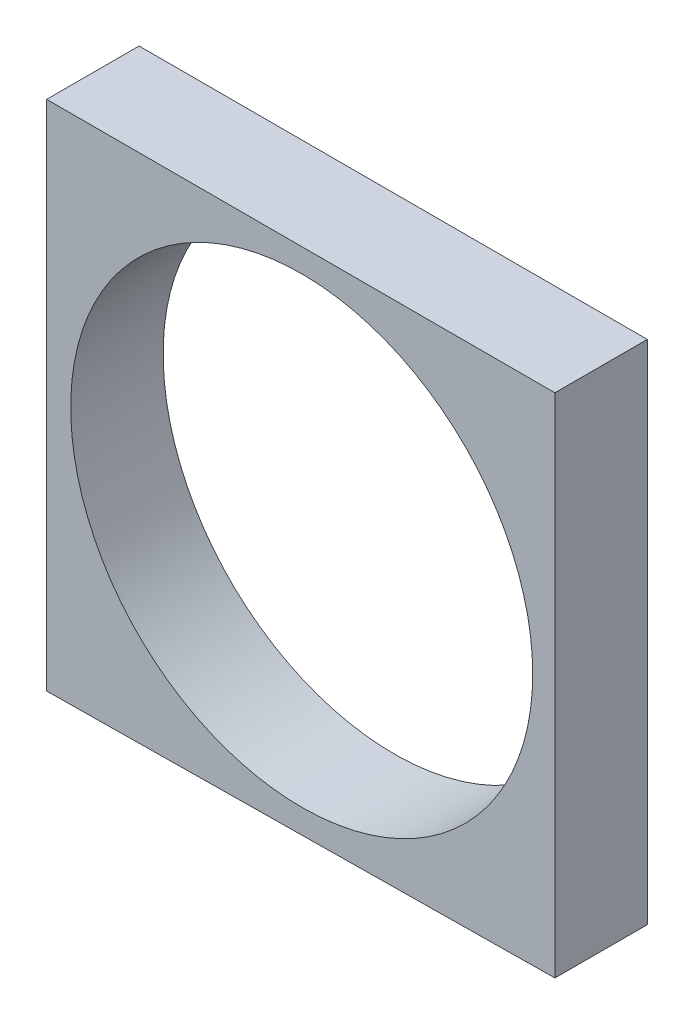
ISO-10303-21;
HEADER;
FILE_DESCRIPTION(('STEP AP214'),'2;1');
FILE_NAME('part.step','',(''),(''),'','','');
FILE_SCHEMA(('AUTOMOTIVE_DESIGN { 1 0 10303 214 1 1 1 1 }'));
ENDSEC;
DATA;
#1=APPLICATION_CONTEXT('core data for automotive mechanical design processes');
#2=APPLICATION_PROTOCOL_DEFINITION('international standard','automotive_design',2000,#1);
#3=PRODUCT_CONTEXT('',#1,'mechanical');
#4=PRODUCT('Part','Part','',(#3));
#5=PRODUCT_RELATED_PRODUCT_CATEGORY('part','',(#4));
#6=PRODUCT_DEFINITION_FORMATION('','',#4);
#7=PRODUCT_DEFINITION_CONTEXT('part definition',#1,'design');
#8=PRODUCT_DEFINITION('design','',#6,#7);
#9=PRODUCT_DEFINITION_SHAPE('','',#8);
#10=(LENGTH_UNIT() NAMED_UNIT(*) SI_UNIT(.MILLI.,.METRE.));
#11=(NAMED_UNIT(*) PLANE_ANGLE_UNIT() SI_UNIT($,.RADIAN.));
#12=(NAMED_UNIT(*) SI_UNIT($,.STERADIAN.) SOLID_ANGLE_UNIT());
#13=UNCERTAINTY_MEASURE_WITH_UNIT(LENGTH_MEASURE(1.E-05),#10,'distance_accuracy_value','');
#14=(GEOMETRIC_REPRESENTATION_CONTEXT(3) GLOBAL_UNCERTAINTY_ASSIGNED_CONTEXT((#13)) GLOBAL_UNIT_ASSIGNED_CONTEXT((#10,
#11,#12)) REPRESENTATION_CONTEXT('',''));
#15=CARTESIAN_POINT('',(0.,0.,0.));
#16=DIRECTION('',(0.,0.,1.));
#17=DIRECTION('',(1.,0.,0.));
#18=AXIS2_PLACEMENT_3D('',#15,#16,#17);
#19=CARTESIAN_POINT('',(0.,0.,12.7));
#20=DIRECTION('',(0.,0.,-1.));
#21=DIRECTION('',(-1.,0.,0.));
#22=AXIS2_PLACEMENT_3D('',#19,#20,#21);
#23=PLANE('',#22);
#24=DIRECTION('',(0.,1.,0.));
#25=VECTOR('',#24,1.);
#26=CARTESIAN_POINT('',(34.798,-34.668162611274,12.7));
#27=LINE('',#26,#25);
#28=CARTESIAN_POINT('',(34.798,-34.668162611274,12.7));
#29=VERTEX_POINT('',#28);
#30=CARTESIAN_POINT('',(34.798,34.9885,12.7));
#31=VERTEX_POINT('',#30);
#32=EDGE_CURVE('E85',#29,#31,#27,.T.);
#33=ORIENTED_EDGE('',*,*,#32,.T.);
#34=DIRECTION('',(-1.,0.,0.));
#35=VECTOR('',#34,1.);
#36=CARTESIAN_POINT('',(-35.052,34.9885,12.7));
#37=LINE('',#36,#35);
#38=CARTESIAN_POINT('',(-35.052,34.9885,12.7));
#39=VERTEX_POINT('',#38);
#40=EDGE_CURVE('E80',#31,#39,#37,.T.);
#41=ORIENTED_EDGE('',*,*,#40,.T.);
#42=DIRECTION('',(0.,-1.,0.));
#43=VECTOR('',#42,1.);
#44=CARTESIAN_POINT('',(-35.052,34.9885,12.7));
#45=LINE('',#44,#43);
#46=CARTESIAN_POINT('',(-35.052,-35.4429675829229,12.7));
#47=VERTEX_POINT('',#46);
#48=EDGE_CURVE('E83',#39,#47,#45,.T.);
#49=ORIENTED_EDGE('',*,*,#48,.T.);
#50=DIRECTION('',(0.999938484875683,0.011091729555114,0.));
#51=VECTOR('',#50,1.);
#52=CARTESIAN_POINT('',(-35.052,-35.4429675829229,12.7));
#53=LINE('',#52,#51);
#54=EDGE_CURVE('E50',#47,#29,#53,.T.);
#55=ORIENTED_EDGE('',*,*,#54,.T.);
#56=EDGE_LOOP('',(#33,#41,#49,#55));
#57=FACE_BOUND('',#56,.T.);
#58=CARTESIAN_POINT('',(0.,0.,12.7));
#59=DIRECTION('',(0.,0.,1.));
#60=DIRECTION('',(1.,0.,0.));
#61=AXIS2_PLACEMENT_3D('',#58,#59,#60);
#62=CIRCLE('',#61,31.75);
#63=CARTESIAN_POINT('',(31.75,0.,12.7));
#64=VERTEX_POINT('',#63);
#65=EDGE_CURVE('E100',#64,#64,#62,.T.);
#66=ORIENTED_EDGE('',*,*,#65,.F.);
#67=EDGE_LOOP('',(#66));
#68=FACE_BOUND('',#67,.T.);
#69=ADVANCED_FACE('F33',(#57,#68),#23,.F.);
#70=CARTESIAN_POINT('',(0.,0.,0.));
#71=DIRECTION('',(0.,0.,-1.));
#72=DIRECTION('',(-1.,0.,0.));
#73=AXIS2_PLACEMENT_3D('',#70,#71,#72);
#74=PLANE('',#73);
#75=DIRECTION('',(0.,1.,0.));
#76=VECTOR('',#75,1.);
#77=CARTESIAN_POINT('',(34.798,-34.668162611274,0.));
#78=LINE('',#77,#76);
#79=CARTESIAN_POINT('',(34.798,-34.668162611274,0.));
#80=VERTEX_POINT('',#79);
#81=CARTESIAN_POINT('',(34.798,34.9885,0.));
#82=VERTEX_POINT('',#81);
#83=EDGE_CURVE('E97',#80,#82,#78,.T.);
#84=ORIENTED_EDGE('',*,*,#83,.F.);
#85=DIRECTION('',(0.999938484875683,0.011091729555114,0.));
#86=VECTOR('',#85,1.);
#87=CARTESIAN_POINT('',(-35.052,-35.4429675829229,0.));
#88=LINE('',#87,#86);
#89=CARTESIAN_POINT('',(-35.052,-35.4429675829229,0.));
#90=VERTEX_POINT('',#89);
#91=EDGE_CURVE('E73',#90,#80,#88,.T.);
#92=ORIENTED_EDGE('',*,*,#91,.F.);
#93=DIRECTION('',(0.,-1.,0.));
#94=VECTOR('',#93,1.);
#95=CARTESIAN_POINT('',(-35.052,34.9885,0.));
#96=LINE('',#95,#94);
#97=CARTESIAN_POINT('',(-35.052,34.9885,0.));
#98=VERTEX_POINT('',#97);
#99=EDGE_CURVE('E67',#98,#90,#96,.T.);
#100=ORIENTED_EDGE('',*,*,#99,.F.);
#101=DIRECTION('',(-1.,0.,0.));
#102=VECTOR('',#101,1.);
#103=CARTESIAN_POINT('',(-35.052,34.9885,0.));
#104=LINE('',#103,#102);
#105=EDGE_CURVE('E89',#82,#98,#104,.T.);
#106=ORIENTED_EDGE('',*,*,#105,.F.);
#107=EDGE_LOOP('',(#84,#92,#100,#106));
#108=FACE_BOUND('',#107,.T.);
#109=CARTESIAN_POINT('',(0.,0.,0.));
#110=DIRECTION('',(0.,0.,1.));
#111=DIRECTION('',(1.,0.,0.));
#112=AXIS2_PLACEMENT_3D('',#109,#110,#111);
#113=CIRCLE('',#112,31.75);
#114=CARTESIAN_POINT('',(31.75,0.,0.));
#115=VERTEX_POINT('',#114);
#116=EDGE_CURVE('E112',#115,#115,#113,.T.);
#117=ORIENTED_EDGE('',*,*,#116,.T.);
#118=EDGE_LOOP('',(#117));
#119=FACE_BOUND('',#118,.T.);
#120=ADVANCED_FACE('F108',(#108,#119),#74,.T.);
#121=CARTESIAN_POINT('',(34.798,-34.668162611274,12.7));
#122=DIRECTION('',(-1.,0.,0.));
#123=DIRECTION('',(0.,0.,1.));
#124=AXIS2_PLACEMENT_3D('',#121,#122,#123);
#125=PLANE('',#124);
#126=ORIENTED_EDGE('',*,*,#83,.T.);
#127=DIRECTION('',(0.,0.,-1.));
#128=VECTOR('',#127,1.);
#129=CARTESIAN_POINT('',(34.798,34.9885,12.7));
#130=LINE('',#129,#128);
#131=EDGE_CURVE('E11',#31,#82,#130,.T.);
#132=ORIENTED_EDGE('',*,*,#131,.F.);
#133=ORIENTED_EDGE('',*,*,#32,.F.);
#134=DIRECTION('',(0.,0.,-1.));
#135=VECTOR('',#134,1.);
#136=CARTESIAN_POINT('',(34.798,-34.668162611274,12.7));
#137=LINE('',#136,#135);
#138=EDGE_CURVE('E93',#29,#80,#137,.T.);
#139=ORIENTED_EDGE('',*,*,#138,.T.);
#140=EDGE_LOOP('',(#126,#132,#133,#139));
#141=FACE_BOUND('',#140,.T.);
#142=ADVANCED_FACE('F35',(#141),#125,.F.);
#143=CARTESIAN_POINT('',(-35.052,34.9885,12.7));
#144=DIRECTION('',(0.,-1.,0.));
#145=DIRECTION('',(0.,0.,-1.));
#146=AXIS2_PLACEMENT_3D('',#143,#144,#145);
#147=PLANE('',#146);
#148=ORIENTED_EDGE('',*,*,#105,.T.);
#149=DIRECTION('',(0.,0.,-1.));
#150=VECTOR('',#149,1.);
#151=CARTESIAN_POINT('',(-35.052,34.9885,12.7));
#152=LINE('',#151,#150);
#153=EDGE_CURVE('E42',#39,#98,#152,.T.);
#154=ORIENTED_EDGE('',*,*,#153,.F.);
#155=ORIENTED_EDGE('',*,*,#40,.F.);
#156=ORIENTED_EDGE('',*,*,#131,.T.);
#157=EDGE_LOOP('',(#148,#154,#155,#156));
#158=FACE_BOUND('',#157,.T.);
#159=ADVANCED_FACE('F88',(#158),#147,.F.);
#160=CARTESIAN_POINT('',(-35.052,34.9885,12.7));
#161=DIRECTION('',(1.,0.,0.));
#162=DIRECTION('',(0.,1.,0.));
#163=AXIS2_PLACEMENT_3D('',#160,#161,#162);
#164=PLANE('',#163);
#165=ORIENTED_EDGE('',*,*,#99,.T.);
#166=DIRECTION('',(0.,0.,-1.));
#167=VECTOR('',#166,1.);
#168=CARTESIAN_POINT('',(-35.052,-35.4429675829229,12.7));
#169=LINE('',#168,#167);
#170=EDGE_CURVE('E90',#47,#90,#169,.T.);
#171=ORIENTED_EDGE('',*,*,#170,.F.);
#172=ORIENTED_EDGE('',*,*,#48,.F.);
#173=ORIENTED_EDGE('',*,*,#153,.T.);
#174=EDGE_LOOP('',(#165,#171,#172,#173));
#175=FACE_BOUND('',#174,.T.);
#176=ADVANCED_FACE('F91',(#175),#164,.F.);
#177=CARTESIAN_POINT('',(-35.052,-35.4429675829229,12.7));
#178=DIRECTION('',(-0.011091729555114,0.999938484875683,0.));
#179=DIRECTION('',(-0.999938484875683,-0.011091729555114,0.));
#180=AXIS2_PLACEMENT_3D('',#177,#178,#179);
#181=PLANE('',#180);
#182=ORIENTED_EDGE('',*,*,#91,.T.);
#183=ORIENTED_EDGE('',*,*,#138,.F.);
#184=ORIENTED_EDGE('',*,*,#54,.F.);
#185=ORIENTED_EDGE('',*,*,#170,.T.);
#186=EDGE_LOOP('',(#182,#183,#184,#185));
#187=FACE_BOUND('',#186,.T.);
#188=ADVANCED_FACE('F105',(#187),#181,.F.);
#189=CARTESIAN_POINT('',(0.,0.,12.7));
#190=DIRECTION('',(0.,0.,-1.));
#191=DIRECTION('',(-1.,0.,0.));
#192=AXIS2_PLACEMENT_3D('',#189,#190,#191);
#193=CYLINDRICAL_SURFACE('',#192,31.75);
#194=ORIENTED_EDGE('',*,*,#65,.T.);
#195=EDGE_LOOP('',(#194));
#196=FACE_BOUND('',#195,.T.);
#197=ORIENTED_EDGE('',*,*,#116,.F.);
#198=EDGE_LOOP('',(#197));
#199=FACE_BOUND('',#198,.T.);
#200=ADVANCED_FACE('F118',(#196,#199),#193,.F.);
#201=CLOSED_SHELL('',(#69,#120,#142,#159,#176,#188,#200));
#202=MANIFOLD_SOLID_BREP('B2',#201);
#203=ADVANCED_BREP_SHAPE_REPRESENTATION('',(#18,#202),#14);
#204=SHAPE_DEFINITION_REPRESENTATION(#9,#203);
ENDSEC;
END-ISO-10303-21;
